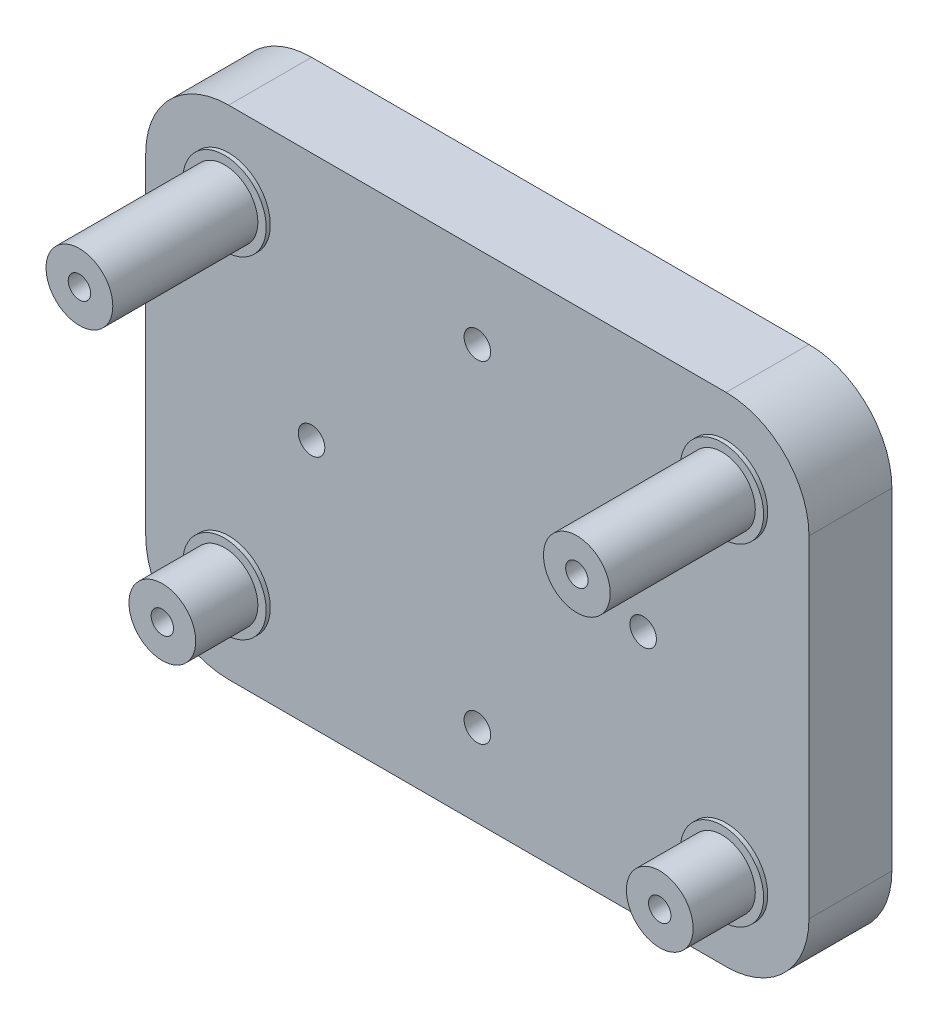
ISO-10303-21;
HEADER;
FILE_DESCRIPTION(('STEP AP214'),'2;1');
FILE_NAME('part.step','',(''),(''),'','','');
FILE_SCHEMA(('AUTOMOTIVE_DESIGN { 1 0 10303 214 1 1 1 1 }'));
ENDSEC;
DATA;
#1=APPLICATION_CONTEXT('core data for automotive mechanical design processes');
#2=APPLICATION_PROTOCOL_DEFINITION('international standard','automotive_design',2000,#1);
#3=PRODUCT_CONTEXT('',#1,'mechanical');
#4=PRODUCT('Part','Part','',(#3));
#5=PRODUCT_RELATED_PRODUCT_CATEGORY('part','',(#4));
#6=PRODUCT_DEFINITION_FORMATION('','',#4);
#7=PRODUCT_DEFINITION_CONTEXT('part definition',#1,'design');
#8=PRODUCT_DEFINITION('design','',#6,#7);
#9=PRODUCT_DEFINITION_SHAPE('','',#8);
#10=(LENGTH_UNIT() NAMED_UNIT(*) SI_UNIT(.MILLI.,.METRE.));
#11=(NAMED_UNIT(*) PLANE_ANGLE_UNIT() SI_UNIT($,.RADIAN.));
#12=(NAMED_UNIT(*) SI_UNIT($,.STERADIAN.) SOLID_ANGLE_UNIT());
#13=UNCERTAINTY_MEASURE_WITH_UNIT(LENGTH_MEASURE(1.E-05),#10,'distance_accuracy_value','');
#14=(GEOMETRIC_REPRESENTATION_CONTEXT(3) GLOBAL_UNCERTAINTY_ASSIGNED_CONTEXT((#13)) GLOBAL_UNIT_ASSIGNED_CONTEXT((#10,
#11,#12)) REPRESENTATION_CONTEXT('',''));
#15=CARTESIAN_POINT('',(0.,0.,0.));
#16=DIRECTION('',(0.,0.,1.));
#17=DIRECTION('',(1.,0.,0.));
#18=AXIS2_PLACEMENT_3D('',#15,#16,#17);
#19=CARTESIAN_POINT('',(-40.,30.,-10.));
#20=DIRECTION('',(0.,-1.,0.));
#21=DIRECTION('',(0.,0.,-1.));
#22=AXIS2_PLACEMENT_3D('',#19,#20,#21);
#23=PLANE('',#22);
#24=DIRECTION('',(1.,0.,0.));
#25=VECTOR('',#24,1.);
#26=CARTESIAN_POINT('',(-40.,30.,0.));
#27=LINE('',#26,#25);
#28=CARTESIAN_POINT('',(-30.,30.,0.));
#29=VERTEX_POINT('',#28);
#30=CARTESIAN_POINT('',(30.,30.,0.));
#31=VERTEX_POINT('',#30);
#32=EDGE_CURVE('E138',#29,#31,#27,.T.);
#33=ORIENTED_EDGE('',*,*,#32,.T.);
#34=DIRECTION('',(0.,0.,1.));
#35=VECTOR('',#34,1.);
#36=CARTESIAN_POINT('',(30.,30.,-10.));
#37=LINE('',#36,#35);
#38=CARTESIAN_POINT('',(30.,30.,-10.));
#39=VERTEX_POINT('',#38);
#40=EDGE_CURVE('E113',#31,#39,#37,.F.);
#41=ORIENTED_EDGE('',*,*,#40,.T.);
#42=DIRECTION('',(1.,0.,0.));
#43=VECTOR('',#42,1.);
#44=CARTESIAN_POINT('',(-40.,30.,-10.));
#45=LINE('',#44,#43);
#46=CARTESIAN_POINT('',(-30.,30.,-10.));
#47=VERTEX_POINT('',#46);
#48=EDGE_CURVE('E151',#47,#39,#45,.T.);
#49=ORIENTED_EDGE('',*,*,#48,.F.);
#50=DIRECTION('',(0.,0.,1.));
#51=VECTOR('',#50,1.);
#52=CARTESIAN_POINT('',(-30.,30.,0.));
#53=LINE('',#52,#51);
#54=EDGE_CURVE('E119',#47,#29,#53,.T.);
#55=ORIENTED_EDGE('',*,*,#54,.T.);
#56=EDGE_LOOP('',(#33,#41,#49,#55));
#57=FACE_BOUND('',#56,.T.);
#58=ADVANCED_FACE('F41',(#57),#23,.F.);
#59=CARTESIAN_POINT('',(40.,30.,-10.));
#60=DIRECTION('',(-1.,0.,0.));
#61=DIRECTION('',(0.,0.,1.));
#62=AXIS2_PLACEMENT_3D('',#59,#60,#61);
#63=PLANE('',#62);
#64=DIRECTION('',(0.,-1.,0.));
#65=VECTOR('',#64,1.);
#66=CARTESIAN_POINT('',(40.,30.,-10.));
#67=LINE('',#66,#65);
#68=CARTESIAN_POINT('',(40.,20.,-10.));
#69=VERTEX_POINT('',#68);
#70=CARTESIAN_POINT('',(40.,-20.,-10.));
#71=VERTEX_POINT('',#70);
#72=EDGE_CURVE('E129',#69,#71,#67,.T.);
#73=ORIENTED_EDGE('',*,*,#72,.F.);
#74=DIRECTION('',(0.,0.,1.));
#75=VECTOR('',#74,1.);
#76=CARTESIAN_POINT('',(40.,20.,-10.));
#77=LINE('',#76,#75);
#78=CARTESIAN_POINT('',(40.,20.,0.));
#79=VERTEX_POINT('',#78);
#80=EDGE_CURVE('E112',#69,#79,#77,.T.);
#81=ORIENTED_EDGE('',*,*,#80,.T.);
#82=DIRECTION('',(0.,-1.,0.));
#83=VECTOR('',#82,1.);
#84=CARTESIAN_POINT('',(40.,30.,0.));
#85=LINE('',#84,#83);
#86=CARTESIAN_POINT('',(40.,-20.,0.));
#87=VERTEX_POINT('',#86);
#88=EDGE_CURVE('E126',#79,#87,#85,.T.);
#89=ORIENTED_EDGE('',*,*,#88,.T.);
#90=DIRECTION('',(0.,0.,1.));
#91=VECTOR('',#90,1.);
#92=CARTESIAN_POINT('',(40.,-20.,-10.));
#93=LINE('',#92,#91);
#94=EDGE_CURVE('E132',#87,#71,#93,.F.);
#95=ORIENTED_EDGE('',*,*,#94,.T.);
#96=EDGE_LOOP('',(#73,#81,#89,#95));
#97=FACE_BOUND('',#96,.T.);
#98=ADVANCED_FACE('F125',(#97),#63,.F.);
#99=CARTESIAN_POINT('',(-40.,-30.,-10.));
#100=DIRECTION('',(0.,-1.,0.));
#101=DIRECTION('',(0.,0.,-1.));
#102=AXIS2_PLACEMENT_3D('',#99,#100,#101);
#103=PLANE('',#102);
#104=DIRECTION('',(1.,0.,0.));
#105=VECTOR('',#104,1.);
#106=CARTESIAN_POINT('',(-40.,-30.,-10.));
#107=LINE('',#106,#105);
#108=CARTESIAN_POINT('',(-30.,-30.,-10.));
#109=VERTEX_POINT('',#108);
#110=CARTESIAN_POINT('',(30.,-30.,-10.));
#111=VERTEX_POINT('',#110);
#112=EDGE_CURVE('E221',#109,#111,#107,.T.);
#113=ORIENTED_EDGE('',*,*,#112,.T.);
#114=DIRECTION('',(0.,0.,1.));
#115=VECTOR('',#114,1.);
#116=CARTESIAN_POINT('',(30.,-30.,0.));
#117=LINE('',#116,#115);
#118=CARTESIAN_POINT('',(30.,-30.,0.));
#119=VERTEX_POINT('',#118);
#120=EDGE_CURVE('E215',#111,#119,#117,.T.);
#121=ORIENTED_EDGE('',*,*,#120,.T.);
#122=DIRECTION('',(1.,0.,0.));
#123=VECTOR('',#122,1.);
#124=CARTESIAN_POINT('',(-40.,-30.,0.));
#125=LINE('',#124,#123);
#126=CARTESIAN_POINT('',(-30.,-30.,0.));
#127=VERTEX_POINT('',#126);
#128=EDGE_CURVE('E137',#127,#119,#125,.T.);
#129=ORIENTED_EDGE('',*,*,#128,.F.);
#130=DIRECTION('',(0.,0.,1.));
#131=VECTOR('',#130,1.);
#132=CARTESIAN_POINT('',(-30.,-30.,-10.));
#133=LINE('',#132,#131);
#134=EDGE_CURVE('E212',#127,#109,#133,.F.);
#135=ORIENTED_EDGE('',*,*,#134,.T.);
#136=EDGE_LOOP('',(#113,#121,#129,#135));
#137=FACE_BOUND('',#136,.T.);
#138=ADVANCED_FACE('F373',(#137),#103,.T.);
#139=CARTESIAN_POINT('',(-40.,30.,-10.));
#140=DIRECTION('',(-1.,0.,0.));
#141=DIRECTION('',(0.,0.,1.));
#142=AXIS2_PLACEMENT_3D('',#139,#140,#141);
#143=PLANE('',#142);
#144=DIRECTION('',(0.,-1.,0.));
#145=VECTOR('',#144,1.);
#146=CARTESIAN_POINT('',(-40.,30.,-10.));
#147=LINE('',#146,#145);
#148=CARTESIAN_POINT('',(-40.,20.,-10.));
#149=VERTEX_POINT('',#148);
#150=CARTESIAN_POINT('',(-40.,-20.,-10.));
#151=VERTEX_POINT('',#150);
#152=EDGE_CURVE('E157',#149,#151,#147,.T.);
#153=ORIENTED_EDGE('',*,*,#152,.T.);
#154=DIRECTION('',(0.,0.,1.));
#155=VECTOR('',#154,1.);
#156=CARTESIAN_POINT('',(-40.,-20.,-10.));
#157=LINE('',#156,#155);
#158=CARTESIAN_POINT('',(-40.,-20.,0.));
#159=VERTEX_POINT('',#158);
#160=EDGE_CURVE('E11',#151,#159,#157,.T.);
#161=ORIENTED_EDGE('',*,*,#160,.T.);
#162=DIRECTION('',(0.,-1.,0.));
#163=VECTOR('',#162,1.);
#164=CARTESIAN_POINT('',(-40.,30.,0.));
#165=LINE('',#164,#163);
#166=CARTESIAN_POINT('',(-40.,20.,0.));
#167=VERTEX_POINT('',#166);
#168=EDGE_CURVE('E142',#167,#159,#165,.T.);
#169=ORIENTED_EDGE('',*,*,#168,.F.);
#170=DIRECTION('',(0.,0.,1.));
#171=VECTOR('',#170,1.);
#172=CARTESIAN_POINT('',(-40.,20.,-10.));
#173=LINE('',#172,#171);
#174=EDGE_CURVE('E50',#167,#149,#173,.F.);
#175=ORIENTED_EDGE('',*,*,#174,.T.);
#176=EDGE_LOOP('',(#153,#161,#169,#175));
#177=FACE_BOUND('',#176,.T.);
#178=ADVANCED_FACE('F391',(#177),#143,.T.);
#179=CARTESIAN_POINT('',(0.,0.,-10.));
#180=DIRECTION('',(0.,0.,-1.));
#181=DIRECTION('',(-1.,0.,0.));
#182=AXIS2_PLACEMENT_3D('',#179,#180,#181);
#183=PLANE('',#182);
#184=CARTESIAN_POINT('',(0.,20.,-10.));
#185=DIRECTION('',(0.,0.,1.));
#186=DIRECTION('',(1.,0.,0.));
#187=AXIS2_PLACEMENT_3D('',#184,#185,#186);
#188=CIRCLE('',#187,1.6);
#189=CARTESIAN_POINT('',(1.6,20.,-10.));
#190=VERTEX_POINT('',#189);
#191=EDGE_CURVE('E174',#190,#190,#188,.T.);
#192=ORIENTED_EDGE('',*,*,#191,.T.);
#193=EDGE_LOOP('',(#192));
#194=FACE_BOUND('',#193,.T.);
#195=CARTESIAN_POINT('',(-20.,0.,-10.));
#196=DIRECTION('',(0.,0.,1.));
#197=DIRECTION('',(1.,0.,0.));
#198=AXIS2_PLACEMENT_3D('',#195,#196,#197);
#199=CIRCLE('',#198,1.6);
#200=CARTESIAN_POINT('',(-18.4,0.,-10.));
#201=VERTEX_POINT('',#200);
#202=EDGE_CURVE('E317',#201,#201,#199,.T.);
#203=ORIENTED_EDGE('',*,*,#202,.T.);
#204=EDGE_LOOP('',(#203));
#205=FACE_BOUND('',#204,.T.);
#206=CARTESIAN_POINT('',(0.,-20.,-10.));
#207=DIRECTION('',(0.,0.,1.));
#208=DIRECTION('',(1.,0.,0.));
#209=AXIS2_PLACEMENT_3D('',#206,#207,#208);
#210=CIRCLE('',#209,1.6);
#211=CARTESIAN_POINT('',(1.6,-20.,-10.));
#212=VERTEX_POINT('',#211);
#213=EDGE_CURVE('E313',#212,#212,#210,.T.);
#214=ORIENTED_EDGE('',*,*,#213,.T.);
#215=EDGE_LOOP('',(#214));
#216=FACE_BOUND('',#215,.T.);
#217=CARTESIAN_POINT('',(20.,0.,-10.));
#218=DIRECTION('',(0.,0.,1.));
#219=DIRECTION('',(1.,0.,0.));
#220=AXIS2_PLACEMENT_3D('',#217,#218,#219);
#221=CIRCLE('',#220,1.6);
#222=CARTESIAN_POINT('',(21.6,0.,-10.));
#223=VERTEX_POINT('',#222);
#224=EDGE_CURVE('E309',#223,#223,#221,.T.);
#225=ORIENTED_EDGE('',*,*,#224,.T.);
#226=EDGE_LOOP('',(#225));
#227=FACE_BOUND('',#226,.T.);
#228=ORIENTED_EDGE('',*,*,#48,.T.);
#229=CARTESIAN_POINT('',(30.,20.,-10.));
#230=DIRECTION('',(0.,0.,-1.));
#231=DIRECTION('',(-1.,0.,0.));
#232=AXIS2_PLACEMENT_3D('',#229,#230,#231);
#233=CIRCLE('',#232,10.);
#234=EDGE_CURVE('E209',#39,#69,#233,.T.);
#235=ORIENTED_EDGE('',*,*,#234,.T.);
#236=ORIENTED_EDGE('',*,*,#72,.T.);
#237=CARTESIAN_POINT('',(30.,-20.,-10.));
#238=DIRECTION('',(0.,0.,-1.));
#239=DIRECTION('',(-1.,0.,0.));
#240=AXIS2_PLACEMENT_3D('',#237,#238,#239);
#241=CIRCLE('',#240,10.);
#242=EDGE_CURVE('E206',#71,#111,#241,.T.);
#243=ORIENTED_EDGE('',*,*,#242,.T.);
#244=ORIENTED_EDGE('',*,*,#112,.F.);
#245=CARTESIAN_POINT('',(-30.,-20.,-10.));
#246=DIRECTION('',(0.,0.,-1.));
#247=DIRECTION('',(-1.,0.,0.));
#248=AXIS2_PLACEMENT_3D('',#245,#246,#247);
#249=CIRCLE('',#248,10.);
#250=EDGE_CURVE('E57',#109,#151,#249,.T.);
#251=ORIENTED_EDGE('',*,*,#250,.T.);
#252=ORIENTED_EDGE('',*,*,#152,.F.);
#253=CARTESIAN_POINT('',(-30.,20.,-10.));
#254=DIRECTION('',(0.,0.,-1.));
#255=DIRECTION('',(-1.,0.,0.));
#256=AXIS2_PLACEMENT_3D('',#253,#254,#255);
#257=CIRCLE('',#256,10.);
#258=EDGE_CURVE('E201',#149,#47,#257,.T.);
#259=ORIENTED_EDGE('',*,*,#258,.T.);
#260=EDGE_LOOP('',(#228,#235,#236,#243,#244,#251,#252,#259));
#261=FACE_BOUND('',#260,.T.);
#262=ADVANCED_FACE('F325',(#194,#205,#216,#227,#261),#183,.T.);
#263=CARTESIAN_POINT('',(0.,0.,0.));
#264=DIRECTION('',(0.,0.,-1.));
#265=DIRECTION('',(-1.,0.,0.));
#266=AXIS2_PLACEMENT_3D('',#263,#264,#265);
#267=PLANE('',#266);
#268=CARTESIAN_POINT('',(0.,20.,0.));
#269=DIRECTION('',(0.,0.,-1.));
#270=DIRECTION('',(-1.,0.,0.));
#271=AXIS2_PLACEMENT_3D('',#268,#269,#270);
#272=CIRCLE('',#271,1.6);
#273=CARTESIAN_POINT('',(-1.6,20.,0.));
#274=VERTEX_POINT('',#273);
#275=EDGE_CURVE('E182',#274,#274,#272,.T.);
#276=ORIENTED_EDGE('',*,*,#275,.T.);
#277=EDGE_LOOP('',(#276));
#278=FACE_BOUND('',#277,.T.);
#279=CARTESIAN_POINT('',(-20.,0.,0.));
#280=DIRECTION('',(0.,0.,-1.));
#281=DIRECTION('',(-1.,0.,0.));
#282=AXIS2_PLACEMENT_3D('',#279,#280,#281);
#283=CIRCLE('',#282,1.6);
#284=CARTESIAN_POINT('',(-21.6,0.,0.));
#285=VERTEX_POINT('',#284);
#286=EDGE_CURVE('E178',#285,#285,#283,.T.);
#287=ORIENTED_EDGE('',*,*,#286,.T.);
#288=EDGE_LOOP('',(#287));
#289=FACE_BOUND('',#288,.T.);
#290=CARTESIAN_POINT('',(0.,-20.,0.));
#291=DIRECTION('',(0.,0.,-1.));
#292=DIRECTION('',(-1.,0.,0.));
#293=AXIS2_PLACEMENT_3D('',#290,#291,#292);
#294=CIRCLE('',#293,1.6);
#295=CARTESIAN_POINT('',(-1.6,-20.,0.));
#296=VERTEX_POINT('',#295);
#297=EDGE_CURVE('E173',#296,#296,#294,.T.);
#298=ORIENTED_EDGE('',*,*,#297,.T.);
#299=EDGE_LOOP('',(#298));
#300=FACE_BOUND('',#299,.T.);
#301=CARTESIAN_POINT('',(20.,0.,0.));
#302=DIRECTION('',(0.,0.,-1.));
#303=DIRECTION('',(-1.,0.,0.));
#304=AXIS2_PLACEMENT_3D('',#301,#302,#303);
#305=CIRCLE('',#304,1.6);
#306=CARTESIAN_POINT('',(18.4,0.,0.));
#307=VERTEX_POINT('',#306);
#308=EDGE_CURVE('E169',#307,#307,#305,.T.);
#309=ORIENTED_EDGE('',*,*,#308,.T.);
#310=EDGE_LOOP('',(#309));
#311=FACE_BOUND('',#310,.T.);
#312=CARTESIAN_POINT('',(-30.,-20.,0.));
#313=DIRECTION('',(0.,0.,-1.));
#314=DIRECTION('',(-1.,0.,0.));
#315=AXIS2_PLACEMENT_3D('',#312,#313,#314);
#316=CIRCLE('',#315,5.025);
#317=CARTESIAN_POINT('',(-35.025,-20.,0.));
#318=VERTEX_POINT('',#317);
#319=EDGE_CURVE('E165',#318,#318,#316,.F.);
#320=ORIENTED_EDGE('',*,*,#319,.F.);
#321=EDGE_LOOP('',(#320));
#322=FACE_BOUND('',#321,.T.);
#323=CARTESIAN_POINT('',(30.,-20.,0.));
#324=DIRECTION('',(0.,0.,-1.));
#325=DIRECTION('',(-1.,0.,0.));
#326=AXIS2_PLACEMENT_3D('',#323,#324,#325);
#327=CIRCLE('',#326,5.025);
#328=CARTESIAN_POINT('',(24.975,-20.,0.));
#329=VERTEX_POINT('',#328);
#330=EDGE_CURVE('E161',#329,#329,#327,.F.);
#331=ORIENTED_EDGE('',*,*,#330,.F.);
#332=EDGE_LOOP('',(#331));
#333=FACE_BOUND('',#332,.T.);
#334=CARTESIAN_POINT('',(30.,20.,0.));
#335=DIRECTION('',(0.,0.,-1.));
#336=DIRECTION('',(-1.,0.,0.));
#337=AXIS2_PLACEMENT_3D('',#334,#335,#336);
#338=CIRCLE('',#337,5.025);
#339=CARTESIAN_POINT('',(24.975,20.,0.));
#340=VERTEX_POINT('',#339);
#341=EDGE_CURVE('E156',#340,#340,#338,.F.);
#342=ORIENTED_EDGE('',*,*,#341,.F.);
#343=EDGE_LOOP('',(#342));
#344=FACE_BOUND('',#343,.T.);
#345=CARTESIAN_POINT('',(-30.,20.,0.));
#346=DIRECTION('',(0.,0.,-1.));
#347=DIRECTION('',(-1.,0.,0.));
#348=AXIS2_PLACEMENT_3D('',#345,#346,#347);
#349=CIRCLE('',#348,5.025);
#350=CARTESIAN_POINT('',(-35.025,20.,0.));
#351=VERTEX_POINT('',#350);
#352=EDGE_CURVE('E152',#351,#351,#349,.F.);
#353=ORIENTED_EDGE('',*,*,#352,.F.);
#354=EDGE_LOOP('',(#353));
#355=FACE_BOUND('',#354,.T.);
#356=ORIENTED_EDGE('',*,*,#88,.F.);
#357=CARTESIAN_POINT('',(30.,20.,0.));
#358=DIRECTION('',(0.,0.,-1.));
#359=DIRECTION('',(-1.,0.,0.));
#360=AXIS2_PLACEMENT_3D('',#357,#358,#359);
#361=CIRCLE('',#360,10.);
#362=EDGE_CURVE('E108',#79,#31,#361,.F.);
#363=ORIENTED_EDGE('',*,*,#362,.T.);
#364=ORIENTED_EDGE('',*,*,#32,.F.);
#365=CARTESIAN_POINT('',(-30.,20.,0.));
#366=DIRECTION('',(0.,0.,-1.));
#367=DIRECTION('',(-1.,0.,0.));
#368=AXIS2_PLACEMENT_3D('',#365,#366,#367);
#369=CIRCLE('',#368,10.);
#370=EDGE_CURVE('E131',#29,#167,#369,.F.);
#371=ORIENTED_EDGE('',*,*,#370,.T.);
#372=ORIENTED_EDGE('',*,*,#168,.T.);
#373=CARTESIAN_POINT('',(-30.,-20.,0.));
#374=DIRECTION('',(0.,0.,-1.));
#375=DIRECTION('',(-1.,0.,0.));
#376=AXIS2_PLACEMENT_3D('',#373,#374,#375);
#377=CIRCLE('',#376,10.);
#378=EDGE_CURVE('E191',#159,#127,#377,.F.);
#379=ORIENTED_EDGE('',*,*,#378,.T.);
#380=ORIENTED_EDGE('',*,*,#128,.T.);
#381=CARTESIAN_POINT('',(30.,-20.,0.));
#382=DIRECTION('',(0.,0.,-1.));
#383=DIRECTION('',(-1.,0.,0.));
#384=AXIS2_PLACEMENT_3D('',#381,#382,#383);
#385=CIRCLE('',#384,10.);
#386=EDGE_CURVE('E120',#119,#87,#385,.F.);
#387=ORIENTED_EDGE('',*,*,#386,.T.);
#388=EDGE_LOOP('',(#356,#363,#364,#371,#372,#379,#380,#387));
#389=FACE_BOUND('',#388,.T.);
#390=ADVANCED_FACE('F134',(#278,#289,#300,#311,#322,#333,#344,#355,#389),#267,.F.);
#391=CARTESIAN_POINT('',(-30.,20.,0.5));
#392=DIRECTION('',(0.,0.,-1.));
#393=DIRECTION('',(-1.,0.,0.));
#394=AXIS2_PLACEMENT_3D('',#391,#392,#393);
#395=CYLINDRICAL_SURFACE('',#394,5.025);
#396=CARTESIAN_POINT('',(-30.,20.,0.5));
#397=DIRECTION('',(0.,0.,1.));
#398=DIRECTION('',(1.,0.,0.));
#399=AXIS2_PLACEMENT_3D('',#396,#397,#398);
#400=CIRCLE('',#399,5.025);
#401=CARTESIAN_POINT('',(-24.975,20.,0.5));
#402=VERTEX_POINT('',#401);
#403=EDGE_CURVE('E272',#402,#402,#400,.T.);
#404=ORIENTED_EDGE('',*,*,#403,.F.);
#405=EDGE_LOOP('',(#404));
#406=FACE_BOUND('',#405,.T.);
#407=ORIENTED_EDGE('',*,*,#352,.T.);
#408=EDGE_LOOP('',(#407));
#409=FACE_BOUND('',#408,.T.);
#410=ADVANCED_FACE('F337',(#406,#409),#395,.T.);
#411=CARTESIAN_POINT('',(0.,0.,0.5));
#412=DIRECTION('',(0.,0.,1.));
#413=DIRECTION('',(1.,0.,0.));
#414=AXIS2_PLACEMENT_3D('',#411,#412,#413);
#415=PLANE('',#414);
#416=CARTESIAN_POINT('',(-30.,20.,0.5));
#417=DIRECTION('',(0.,0.,1.));
#418=DIRECTION('',(1.,0.,0.));
#419=AXIS2_PLACEMENT_3D('',#416,#417,#418);
#420=CIRCLE('',#419,4.025);
#421=CARTESIAN_POINT('',(-25.975,20.,0.5));
#422=VERTEX_POINT('',#421);
#423=EDGE_CURVE('E282',#422,#422,#420,.T.);
#424=ORIENTED_EDGE('',*,*,#423,.F.);
#425=EDGE_LOOP('',(#424));
#426=FACE_BOUND('',#425,.T.);
#427=ORIENTED_EDGE('',*,*,#403,.T.);
#428=EDGE_LOOP('',(#427));
#429=FACE_BOUND('',#428,.T.);
#430=ADVANCED_FACE('F356',(#426,#429),#415,.T.);
#431=CARTESIAN_POINT('',(-30.,20.,0.));
#432=DIRECTION('',(0.,0.,1.));
#433=DIRECTION('',(1.,0.,0.));
#434=AXIS2_PLACEMENT_3D('',#431,#432,#433);
#435=CIRCLE('',#434,1.35);
#436=CARTESIAN_POINT('',(-28.65,20.,0.));
#437=VERTEX_POINT('',#436);
#438=EDGE_CURVE('E255',#437,#437,#435,.T.);
#439=ORIENTED_EDGE('',*,*,#438,.T.);
#440=EDGE_LOOP('',(#439));
#441=FACE_BOUND('',#440,.T.);
#442=ADVANCED_FACE('F362',(#441),#267,.F.);
#443=CARTESIAN_POINT('',(-30.,20.,18.));
#444=DIRECTION('',(0.,0.,-1.));
#445=DIRECTION('',(-1.,0.,0.));
#446=AXIS2_PLACEMENT_3D('',#443,#444,#445);
#447=CYLINDRICAL_SURFACE('',#446,1.35);
#448=CARTESIAN_POINT('',(-30.,20.,18.));
#449=DIRECTION('',(0.,0.,1.));
#450=DIRECTION('',(1.,0.,0.));
#451=AXIS2_PLACEMENT_3D('',#448,#449,#450);
#452=CIRCLE('',#451,1.35);
#453=CARTESIAN_POINT('',(-28.65,20.,18.));
#454=VERTEX_POINT('',#453);
#455=EDGE_CURVE('E259',#454,#454,#452,.T.);
#456=ORIENTED_EDGE('',*,*,#455,.T.);
#457=EDGE_LOOP('',(#456));
#458=FACE_BOUND('',#457,.T.);
#459=ORIENTED_EDGE('',*,*,#438,.F.);
#460=EDGE_LOOP('',(#459));
#461=FACE_BOUND('',#460,.T.);
#462=ADVANCED_FACE('F630',(#458,#461),#447,.F.);
#463=CARTESIAN_POINT('',(0.,0.,18.));
#464=DIRECTION('',(0.,0.,1.));
#465=DIRECTION('',(1.,0.,0.));
#466=AXIS2_PLACEMENT_3D('',#463,#464,#465);
#467=PLANE('',#466);
#468=ORIENTED_EDGE('',*,*,#455,.F.);
#469=EDGE_LOOP('',(#468));
#470=FACE_BOUND('',#469,.T.);
#471=CARTESIAN_POINT('',(-30.,20.,18.));
#472=DIRECTION('',(0.,0.,1.));
#473=DIRECTION('',(1.,0.,0.));
#474=AXIS2_PLACEMENT_3D('',#471,#472,#473);
#475=CIRCLE('',#474,4.025);
#476=CARTESIAN_POINT('',(-25.975,20.,18.));
#477=VERTEX_POINT('',#476);
#478=EDGE_CURVE('E248',#477,#477,#475,.T.);
#479=ORIENTED_EDGE('',*,*,#478,.T.);
#480=EDGE_LOOP('',(#479));
#481=FACE_BOUND('',#480,.T.);
#482=ADVANCED_FACE('F621',(#470,#481),#467,.T.);
#483=CARTESIAN_POINT('',(-30.,20.,18.));
#484=DIRECTION('',(0.,0.,-1.));
#485=DIRECTION('',(-1.,0.,0.));
#486=AXIS2_PLACEMENT_3D('',#483,#484,#485);
#487=CYLINDRICAL_SURFACE('',#486,4.025);
#488=ORIENTED_EDGE('',*,*,#423,.T.);
#489=EDGE_LOOP('',(#488));
#490=FACE_BOUND('',#489,.T.);
#491=ORIENTED_EDGE('',*,*,#478,.F.);
#492=EDGE_LOOP('',(#491));
#493=FACE_BOUND('',#492,.T.);
#494=ADVANCED_FACE('F613',(#490,#493),#487,.T.);
#495=CARTESIAN_POINT('',(30.,20.,0.5));
#496=DIRECTION('',(0.,0.,-1.));
#497=DIRECTION('',(-1.,0.,0.));
#498=AXIS2_PLACEMENT_3D('',#495,#496,#497);
#499=CYLINDRICAL_SURFACE('',#498,5.025);
#500=CARTESIAN_POINT('',(30.,20.,0.5));
#501=DIRECTION('',(0.,0.,1.));
#502=DIRECTION('',(1.,0.,0.));
#503=AXIS2_PLACEMENT_3D('',#500,#501,#502);
#504=CIRCLE('',#503,5.025);
#505=CARTESIAN_POINT('',(35.025,20.,0.5));
#506=VERTEX_POINT('',#505);
#507=EDGE_CURVE('E286',#506,#506,#504,.T.);
#508=ORIENTED_EDGE('',*,*,#507,.F.);
#509=EDGE_LOOP('',(#508));
#510=FACE_BOUND('',#509,.T.);
#511=ORIENTED_EDGE('',*,*,#341,.T.);
#512=EDGE_LOOP('',(#511));
#513=FACE_BOUND('',#512,.T.);
#514=ADVANCED_FACE('F605',(#510,#513),#499,.T.);
#515=CARTESIAN_POINT('',(0.,0.,0.5));
#516=DIRECTION('',(0.,0.,1.));
#517=DIRECTION('',(1.,0.,0.));
#518=AXIS2_PLACEMENT_3D('',#515,#516,#517);
#519=PLANE('',#518);
#520=CARTESIAN_POINT('',(30.,20.,0.5));
#521=DIRECTION('',(0.,0.,1.));
#522=DIRECTION('',(1.,0.,0.));
#523=AXIS2_PLACEMENT_3D('',#520,#521,#522);
#524=CIRCLE('',#523,4.025);
#525=CARTESIAN_POINT('',(34.025,20.,0.5));
#526=VERTEX_POINT('',#525);
#527=EDGE_CURVE('E290',#526,#526,#524,.T.);
#528=ORIENTED_EDGE('',*,*,#527,.F.);
#529=EDGE_LOOP('',(#528));
#530=FACE_BOUND('',#529,.T.);
#531=ORIENTED_EDGE('',*,*,#507,.T.);
#532=EDGE_LOOP('',(#531));
#533=FACE_BOUND('',#532,.T.);
#534=ADVANCED_FACE('F599',(#530,#533),#519,.T.);
#535=CARTESIAN_POINT('',(30.,20.,0.));
#536=DIRECTION('',(0.,0.,1.));
#537=DIRECTION('',(1.,0.,0.));
#538=AXIS2_PLACEMENT_3D('',#535,#536,#537);
#539=CIRCLE('',#538,1.35);
#540=CARTESIAN_POINT('',(31.35,20.,0.));
#541=VERTEX_POINT('',#540);
#542=EDGE_CURVE('E267',#541,#541,#539,.T.);
#543=ORIENTED_EDGE('',*,*,#542,.T.);
#544=EDGE_LOOP('',(#543));
#545=FACE_BOUND('',#544,.T.);
#546=ADVANCED_FACE('F339',(#545),#267,.F.);
#547=CARTESIAN_POINT('',(30.,20.,18.));
#548=DIRECTION('',(0.,0.,-1.));
#549=DIRECTION('',(-1.,0.,0.));
#550=AXIS2_PLACEMENT_3D('',#547,#548,#549);
#551=CYLINDRICAL_SURFACE('',#550,1.35);
#552=CARTESIAN_POINT('',(30.,20.,18.));
#553=DIRECTION('',(0.,0.,1.));
#554=DIRECTION('',(1.,0.,0.));
#555=AXIS2_PLACEMENT_3D('',#552,#553,#554);
#556=CIRCLE('',#555,1.35);
#557=CARTESIAN_POINT('',(31.35,20.,18.));
#558=VERTEX_POINT('',#557);
#559=EDGE_CURVE('E271',#558,#558,#556,.T.);
#560=ORIENTED_EDGE('',*,*,#559,.T.);
#561=EDGE_LOOP('',(#560));
#562=FACE_BOUND('',#561,.T.);
#563=ORIENTED_EDGE('',*,*,#542,.F.);
#564=EDGE_LOOP('',(#563));
#565=FACE_BOUND('',#564,.T.);
#566=ADVANCED_FACE('F584',(#562,#565),#551,.F.);
#567=CARTESIAN_POINT('',(0.,0.,18.));
#568=DIRECTION('',(0.,0.,1.));
#569=DIRECTION('',(1.,0.,0.));
#570=AXIS2_PLACEMENT_3D('',#567,#568,#569);
#571=PLANE('',#570);
#572=ORIENTED_EDGE('',*,*,#559,.F.);
#573=EDGE_LOOP('',(#572));
#574=FACE_BOUND('',#573,.T.);
#575=CARTESIAN_POINT('',(30.,20.,18.));
#576=DIRECTION('',(0.,0.,1.));
#577=DIRECTION('',(1.,0.,0.));
#578=AXIS2_PLACEMENT_3D('',#575,#576,#577);
#579=CIRCLE('',#578,4.025);
#580=CARTESIAN_POINT('',(34.025,20.,18.));
#581=VERTEX_POINT('',#580);
#582=EDGE_CURVE('E260',#581,#581,#579,.T.);
#583=ORIENTED_EDGE('',*,*,#582,.T.);
#584=EDGE_LOOP('',(#583));
#585=FACE_BOUND('',#584,.T.);
#586=ADVANCED_FACE('F575',(#574,#585),#571,.T.);
#587=CARTESIAN_POINT('',(30.,20.,18.));
#588=DIRECTION('',(0.,0.,-1.));
#589=DIRECTION('',(-1.,0.,0.));
#590=AXIS2_PLACEMENT_3D('',#587,#588,#589);
#591=CYLINDRICAL_SURFACE('',#590,4.025);
#592=ORIENTED_EDGE('',*,*,#527,.T.);
#593=EDGE_LOOP('',(#592));
#594=FACE_BOUND('',#593,.T.);
#595=ORIENTED_EDGE('',*,*,#582,.F.);
#596=EDGE_LOOP('',(#595));
#597=FACE_BOUND('',#596,.T.);
#598=ADVANCED_FACE('F567',(#594,#597),#591,.T.);
#599=CARTESIAN_POINT('',(30.,-20.,0.5));
#600=DIRECTION('',(0.,0.,-1.));
#601=DIRECTION('',(-1.,0.,0.));
#602=AXIS2_PLACEMENT_3D('',#599,#600,#601);
#603=CYLINDRICAL_SURFACE('',#602,5.025);
#604=CARTESIAN_POINT('',(30.,-20.,0.5));
#605=DIRECTION('',(0.,0.,1.));
#606=DIRECTION('',(1.,0.,0.));
#607=AXIS2_PLACEMENT_3D('',#604,#605,#606);
#608=CIRCLE('',#607,5.025);
#609=CARTESIAN_POINT('',(35.025,-20.,0.5));
#610=VERTEX_POINT('',#609);
#611=EDGE_CURVE('E294',#610,#610,#608,.T.);
#612=ORIENTED_EDGE('',*,*,#611,.F.);
#613=EDGE_LOOP('',(#612));
#614=FACE_BOUND('',#613,.T.);
#615=ORIENTED_EDGE('',*,*,#330,.T.);
#616=EDGE_LOOP('',(#615));
#617=FACE_BOUND('',#616,.T.);
#618=ADVANCED_FACE('F559',(#614,#617),#603,.T.);
#619=CARTESIAN_POINT('',(0.,0.,0.5));
#620=DIRECTION('',(0.,0.,1.));
#621=DIRECTION('',(1.,0.,0.));
#622=AXIS2_PLACEMENT_3D('',#619,#620,#621);
#623=PLANE('',#622);
#624=CARTESIAN_POINT('',(30.,-20.,0.5));
#625=DIRECTION('',(0.,0.,1.));
#626=DIRECTION('',(1.,0.,0.));
#627=AXIS2_PLACEMENT_3D('',#624,#625,#626);
#628=CIRCLE('',#627,4.025);
#629=CARTESIAN_POINT('',(34.025,-20.,0.5));
#630=VERTEX_POINT('',#629);
#631=EDGE_CURVE('E298',#630,#630,#628,.T.);
#632=ORIENTED_EDGE('',*,*,#631,.F.);
#633=EDGE_LOOP('',(#632));
#634=FACE_BOUND('',#633,.T.);
#635=ORIENTED_EDGE('',*,*,#611,.T.);
#636=EDGE_LOOP('',(#635));
#637=FACE_BOUND('',#636,.T.);
#638=ADVANCED_FACE('F552',(#634,#637),#623,.T.);
#639=CARTESIAN_POINT('',(30.,-20.,0.));
#640=DIRECTION('',(0.,0.,1.));
#641=DIRECTION('',(1.,0.,0.));
#642=AXIS2_PLACEMENT_3D('',#639,#640,#641);
#643=CIRCLE('',#642,1.35);
#644=CARTESIAN_POINT('',(31.35,-20.,0.));
#645=VERTEX_POINT('',#644);
#646=EDGE_CURVE('E243',#645,#645,#643,.T.);
#647=ORIENTED_EDGE('',*,*,#646,.T.);
#648=EDGE_LOOP('',(#647));
#649=FACE_BOUND('',#648,.T.);
#650=ADVANCED_FACE('F508',(#649),#267,.F.);
#651=CARTESIAN_POINT('',(30.,-20.,8.));
#652=DIRECTION('',(0.,0.,-1.));
#653=DIRECTION('',(-1.,0.,0.));
#654=AXIS2_PLACEMENT_3D('',#651,#652,#653);
#655=CYLINDRICAL_SURFACE('',#654,1.35);
#656=CARTESIAN_POINT('',(30.,-20.,8.));
#657=DIRECTION('',(0.,0.,1.));
#658=DIRECTION('',(1.,0.,0.));
#659=AXIS2_PLACEMENT_3D('',#656,#657,#658);
#660=CIRCLE('',#659,1.35);
#661=CARTESIAN_POINT('',(31.35,-20.,8.));
#662=VERTEX_POINT('',#661);
#663=EDGE_CURVE('E247',#662,#662,#660,.T.);
#664=ORIENTED_EDGE('',*,*,#663,.T.);
#665=EDGE_LOOP('',(#664));
#666=FACE_BOUND('',#665,.T.);
#667=ORIENTED_EDGE('',*,*,#646,.F.);
#668=EDGE_LOOP('',(#667));
#669=FACE_BOUND('',#668,.T.);
#670=ADVANCED_FACE('F538',(#666,#669),#655,.F.);
#671=CARTESIAN_POINT('',(0.,0.,8.));
#672=DIRECTION('',(0.,0.,1.));
#673=DIRECTION('',(1.,0.,0.));
#674=AXIS2_PLACEMENT_3D('',#671,#672,#673);
#675=PLANE('',#674);
#676=ORIENTED_EDGE('',*,*,#663,.F.);
#677=EDGE_LOOP('',(#676));
#678=FACE_BOUND('',#677,.T.);
#679=CARTESIAN_POINT('',(30.,-20.,8.));
#680=DIRECTION('',(0.,0.,1.));
#681=DIRECTION('',(1.,0.,0.));
#682=AXIS2_PLACEMENT_3D('',#679,#680,#681);
#683=CIRCLE('',#682,4.025);
#684=CARTESIAN_POINT('',(34.025,-20.,8.));
#685=VERTEX_POINT('',#684);
#686=EDGE_CURVE('E236',#685,#685,#683,.T.);
#687=ORIENTED_EDGE('',*,*,#686,.T.);
#688=EDGE_LOOP('',(#687));
#689=FACE_BOUND('',#688,.T.);
#690=ADVANCED_FACE('F529',(#678,#689),#675,.T.);
#691=CARTESIAN_POINT('',(30.,-20.,8.));
#692=DIRECTION('',(0.,0.,-1.));
#693=DIRECTION('',(-1.,0.,0.));
#694=AXIS2_PLACEMENT_3D('',#691,#692,#693);
#695=CYLINDRICAL_SURFACE('',#694,4.025);
#696=ORIENTED_EDGE('',*,*,#631,.T.);
#697=EDGE_LOOP('',(#696));
#698=FACE_BOUND('',#697,.T.);
#699=ORIENTED_EDGE('',*,*,#686,.F.);
#700=EDGE_LOOP('',(#699));
#701=FACE_BOUND('',#700,.T.);
#702=ADVANCED_FACE('F521',(#698,#701),#695,.T.);
#703=CARTESIAN_POINT('',(-30.,-20.,0.5));
#704=DIRECTION('',(0.,0.,-1.));
#705=DIRECTION('',(-1.,0.,0.));
#706=AXIS2_PLACEMENT_3D('',#703,#704,#705);
#707=CYLINDRICAL_SURFACE('',#706,5.025);
#708=CARTESIAN_POINT('',(-30.,-20.,0.5));
#709=DIRECTION('',(0.,0.,1.));
#710=DIRECTION('',(1.,0.,0.));
#711=AXIS2_PLACEMENT_3D('',#708,#709,#710);
#712=CIRCLE('',#711,5.025);
#713=CARTESIAN_POINT('',(-24.975,-20.,0.5));
#714=VERTEX_POINT('',#713);
#715=EDGE_CURVE('E302',#714,#714,#712,.T.);
#716=ORIENTED_EDGE('',*,*,#715,.F.);
#717=EDGE_LOOP('',(#716));
#718=FACE_BOUND('',#717,.T.);
#719=ORIENTED_EDGE('',*,*,#319,.T.);
#720=EDGE_LOOP('',(#719));
#721=FACE_BOUND('',#720,.T.);
#722=ADVANCED_FACE('F513',(#718,#721),#707,.T.);
#723=CARTESIAN_POINT('',(0.,0.,0.5));
#724=DIRECTION('',(0.,0.,1.));
#725=DIRECTION('',(1.,0.,0.));
#726=AXIS2_PLACEMENT_3D('',#723,#724,#725);
#727=PLANE('',#726);
#728=CARTESIAN_POINT('',(-30.,-20.,0.5));
#729=DIRECTION('',(0.,0.,1.));
#730=DIRECTION('',(1.,0.,0.));
#731=AXIS2_PLACEMENT_3D('',#728,#729,#730);
#732=CIRCLE('',#731,4.025);
#733=CARTESIAN_POINT('',(-25.975,-20.,0.5));
#734=VERTEX_POINT('',#733);
#735=EDGE_CURVE('E186',#734,#734,#732,.T.);
#736=ORIENTED_EDGE('',*,*,#735,.F.);
#737=EDGE_LOOP('',(#736));
#738=FACE_BOUND('',#737,.T.);
#739=ORIENTED_EDGE('',*,*,#715,.T.);
#740=EDGE_LOOP('',(#739));
#741=FACE_BOUND('',#740,.T.);
#742=ADVANCED_FACE('F506',(#738,#741),#727,.T.);
#743=CARTESIAN_POINT('',(-30.,-20.,0.));
#744=DIRECTION('',(0.,0.,1.));
#745=DIRECTION('',(1.,0.,0.));
#746=AXIS2_PLACEMENT_3D('',#743,#744,#745);
#747=CIRCLE('',#746,1.35);
#748=CARTESIAN_POINT('',(-28.65,-20.,0.));
#749=VERTEX_POINT('',#748);
#750=EDGE_CURVE('E231',#749,#749,#747,.T.);
#751=ORIENTED_EDGE('',*,*,#750,.T.);
#752=EDGE_LOOP('',(#751));
#753=FACE_BOUND('',#752,.T.);
#754=ADVANCED_FACE('F340',(#753),#267,.F.);
#755=CARTESIAN_POINT('',(-30.,-20.,8.));
#756=DIRECTION('',(0.,0.,-1.));
#757=DIRECTION('',(-1.,0.,0.));
#758=AXIS2_PLACEMENT_3D('',#755,#756,#757);
#759=CYLINDRICAL_SURFACE('',#758,1.35);
#760=CARTESIAN_POINT('',(-30.,-20.,8.));
#761=DIRECTION('',(0.,0.,1.));
#762=DIRECTION('',(1.,0.,0.));
#763=AXIS2_PLACEMENT_3D('',#760,#761,#762);
#764=CIRCLE('',#763,1.35);
#765=CARTESIAN_POINT('',(-28.65,-20.,8.));
#766=VERTEX_POINT('',#765);
#767=EDGE_CURVE('E235',#766,#766,#764,.T.);
#768=ORIENTED_EDGE('',*,*,#767,.T.);
#769=EDGE_LOOP('',(#768));
#770=FACE_BOUND('',#769,.T.);
#771=ORIENTED_EDGE('',*,*,#750,.F.);
#772=EDGE_LOOP('',(#771));
#773=FACE_BOUND('',#772,.T.);
#774=ADVANCED_FACE('F402',(#770,#773),#759,.F.);
#775=CARTESIAN_POINT('',(0.,0.,8.));
#776=DIRECTION('',(0.,0.,1.));
#777=DIRECTION('',(1.,0.,0.));
#778=AXIS2_PLACEMENT_3D('',#775,#776,#777);
#779=PLANE('',#778);
#780=ORIENTED_EDGE('',*,*,#767,.F.);
#781=EDGE_LOOP('',(#780));
#782=FACE_BOUND('',#781,.T.);
#783=CARTESIAN_POINT('',(-30.,-20.,8.));
#784=DIRECTION('',(0.,0.,1.));
#785=DIRECTION('',(1.,0.,0.));
#786=AXIS2_PLACEMENT_3D('',#783,#784,#785);
#787=CIRCLE('',#786,4.025);
#788=CARTESIAN_POINT('',(-25.975,-20.,8.));
#789=VERTEX_POINT('',#788);
#790=EDGE_CURVE('E144',#789,#789,#787,.T.);
#791=ORIENTED_EDGE('',*,*,#790,.T.);
#792=EDGE_LOOP('',(#791));
#793=FACE_BOUND('',#792,.T.);
#794=ADVANCED_FACE('F485',(#782,#793),#779,.T.);
#795=CARTESIAN_POINT('',(-30.,-20.,8.));
#796=DIRECTION('',(0.,0.,-1.));
#797=DIRECTION('',(-1.,0.,0.));
#798=AXIS2_PLACEMENT_3D('',#795,#796,#797);
#799=CYLINDRICAL_SURFACE('',#798,4.025);
#800=ORIENTED_EDGE('',*,*,#735,.T.);
#801=EDGE_LOOP('',(#800));
#802=FACE_BOUND('',#801,.T.);
#803=ORIENTED_EDGE('',*,*,#790,.F.);
#804=EDGE_LOOP('',(#803));
#805=FACE_BOUND('',#804,.T.);
#806=ADVANCED_FACE('F477',(#802,#805),#799,.T.);
#807=CARTESIAN_POINT('',(20.,0.,-10.));
#808=DIRECTION('',(0.,0.,1.));
#809=DIRECTION('',(1.,0.,0.));
#810=AXIS2_PLACEMENT_3D('',#807,#808,#809);
#811=CYLINDRICAL_SURFACE('',#810,1.6);
#812=ORIENTED_EDGE('',*,*,#224,.F.);
#813=EDGE_LOOP('',(#812));
#814=FACE_BOUND('',#813,.T.);
#815=ORIENTED_EDGE('',*,*,#308,.F.);
#816=EDGE_LOOP('',(#815));
#817=FACE_BOUND('',#816,.T.);
#818=ADVANCED_FACE('F469',(#814,#817),#811,.F.);
#819=CARTESIAN_POINT('',(0.,-20.,-10.));
#820=DIRECTION('',(0.,0.,1.));
#821=DIRECTION('',(1.,0.,0.));
#822=AXIS2_PLACEMENT_3D('',#819,#820,#821);
#823=CYLINDRICAL_SURFACE('',#822,1.6);
#824=ORIENTED_EDGE('',*,*,#213,.F.);
#825=EDGE_LOOP('',(#824));
#826=FACE_BOUND('',#825,.T.);
#827=ORIENTED_EDGE('',*,*,#297,.F.);
#828=EDGE_LOOP('',(#827));
#829=FACE_BOUND('',#828,.T.);
#830=ADVANCED_FACE('F461',(#826,#829),#823,.F.);
#831=CARTESIAN_POINT('',(-20.,0.,-10.));
#832=DIRECTION('',(0.,0.,1.));
#833=DIRECTION('',(1.,0.,0.));
#834=AXIS2_PLACEMENT_3D('',#831,#832,#833);
#835=CYLINDRICAL_SURFACE('',#834,1.6);
#836=ORIENTED_EDGE('',*,*,#202,.F.);
#837=EDGE_LOOP('',(#836));
#838=FACE_BOUND('',#837,.T.);
#839=ORIENTED_EDGE('',*,*,#286,.F.);
#840=EDGE_LOOP('',(#839));
#841=FACE_BOUND('',#840,.T.);
#842=ADVANCED_FACE('F331',(#838,#841),#835,.F.);
#843=CARTESIAN_POINT('',(0.,20.,-10.));
#844=DIRECTION('',(0.,0.,1.));
#845=DIRECTION('',(1.,0.,0.));
#846=AXIS2_PLACEMENT_3D('',#843,#844,#845);
#847=CYLINDRICAL_SURFACE('',#846,1.6);
#848=ORIENTED_EDGE('',*,*,#191,.F.);
#849=EDGE_LOOP('',(#848));
#850=FACE_BOUND('',#849,.T.);
#851=ORIENTED_EDGE('',*,*,#275,.F.);
#852=EDGE_LOOP('',(#851));
#853=FACE_BOUND('',#852,.T.);
#854=ADVANCED_FACE('F328',(#850,#853),#847,.F.);
#855=CARTESIAN_POINT('',(30.,20.,-10.));
#856=DIRECTION('',(0.,0.,1.));
#857=DIRECTION('',(1.,0.,0.));
#858=AXIS2_PLACEMENT_3D('',#855,#856,#857);
#859=CYLINDRICAL_SURFACE('',#858,10.);
#860=ORIENTED_EDGE('',*,*,#234,.F.);
#861=ORIENTED_EDGE('',*,*,#40,.F.);
#862=ORIENTED_EDGE('',*,*,#362,.F.);
#863=ORIENTED_EDGE('',*,*,#80,.F.);
#864=EDGE_LOOP('',(#860,#861,#862,#863));
#865=FACE_BOUND('',#864,.T.);
#866=ADVANCED_FACE('F111',(#865),#859,.T.);
#867=CARTESIAN_POINT('',(30.,-20.,-10.));
#868=DIRECTION('',(0.,0.,-1.));
#869=DIRECTION('',(-1.,0.,0.));
#870=AXIS2_PLACEMENT_3D('',#867,#868,#869);
#871=CYLINDRICAL_SURFACE('',#870,10.);
#872=ORIENTED_EDGE('',*,*,#242,.F.);
#873=ORIENTED_EDGE('',*,*,#94,.F.);
#874=ORIENTED_EDGE('',*,*,#386,.F.);
#875=ORIENTED_EDGE('',*,*,#120,.F.);
#876=EDGE_LOOP('',(#872,#873,#874,#875));
#877=FACE_BOUND('',#876,.T.);
#878=ADVANCED_FACE('F379',(#877),#871,.T.);
#879=CARTESIAN_POINT('',(-30.,-20.,-10.));
#880=DIRECTION('',(0.,0.,1.));
#881=DIRECTION('',(1.,0.,0.));
#882=AXIS2_PLACEMENT_3D('',#879,#880,#881);
#883=CYLINDRICAL_SURFACE('',#882,10.);
#884=ORIENTED_EDGE('',*,*,#250,.F.);
#885=ORIENTED_EDGE('',*,*,#134,.F.);
#886=ORIENTED_EDGE('',*,*,#378,.F.);
#887=ORIENTED_EDGE('',*,*,#160,.F.);
#888=EDGE_LOOP('',(#884,#885,#886,#887));
#889=FACE_BOUND('',#888,.T.);
#890=ADVANCED_FACE('F381',(#889),#883,.T.);
#891=CARTESIAN_POINT('',(-30.,20.,-10.));
#892=DIRECTION('',(0.,0.,-1.));
#893=DIRECTION('',(-1.,0.,0.));
#894=AXIS2_PLACEMENT_3D('',#891,#892,#893);
#895=CYLINDRICAL_SURFACE('',#894,10.);
#896=ORIENTED_EDGE('',*,*,#258,.F.);
#897=ORIENTED_EDGE('',*,*,#174,.F.);
#898=ORIENTED_EDGE('',*,*,#370,.F.);
#899=ORIENTED_EDGE('',*,*,#54,.F.);
#900=EDGE_LOOP('',(#896,#897,#898,#899));
#901=FACE_BOUND('',#900,.T.);
#902=ADVANCED_FACE('F43',(#901),#895,.T.);
#903=CLOSED_SHELL('',(#58,#98,#138,#178,#262,#390,#410,#430,#442,#462,#482,#494,#514,#534,#546,
#566,#586,#598,#618,#638,#650,#670,#690,#702,#722,#742,#754,#774,#794,#806,#818,#830,#842,#854,
#866,#878,#890,#902));
#904=MANIFOLD_SOLID_BREP('B2',#903);
#905=ADVANCED_BREP_SHAPE_REPRESENTATION('',(#18,#904),#14);
#906=SHAPE_DEFINITION_REPRESENTATION(#9,#905);
ENDSEC;
END-ISO-10303-21;
